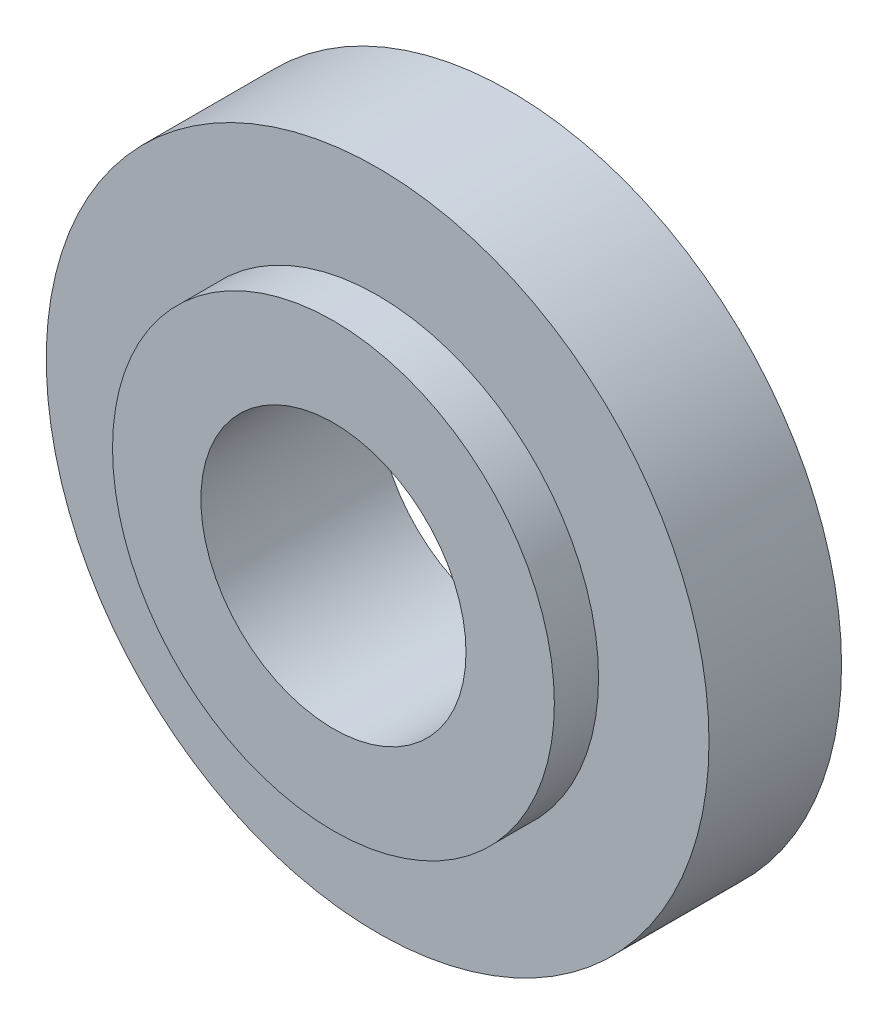
ISO-10303-21;
HEADER;
FILE_DESCRIPTION(('STEP AP214'),'2;1');
FILE_NAME('part.step','',(''),(''),'','','');
FILE_SCHEMA(('AUTOMOTIVE_DESIGN { 1 0 10303 214 1 1 1 1 }'));
ENDSEC;
DATA;
#1=APPLICATION_CONTEXT('core data for automotive mechanical design processes');
#2=APPLICATION_PROTOCOL_DEFINITION('international standard','automotive_design',2000,#1);
#3=PRODUCT_CONTEXT('',#1,'mechanical');
#4=PRODUCT('Part','Part','',(#3));
#5=PRODUCT_RELATED_PRODUCT_CATEGORY('part','',(#4));
#6=PRODUCT_DEFINITION_FORMATION('','',#4);
#7=PRODUCT_DEFINITION_CONTEXT('part definition',#1,'design');
#8=PRODUCT_DEFINITION('design','',#6,#7);
#9=PRODUCT_DEFINITION_SHAPE('','',#8);
#10=(LENGTH_UNIT() NAMED_UNIT(*) SI_UNIT(.MILLI.,.METRE.));
#11=(NAMED_UNIT(*) PLANE_ANGLE_UNIT() SI_UNIT($,.RADIAN.));
#12=(NAMED_UNIT(*) SI_UNIT($,.STERADIAN.) SOLID_ANGLE_UNIT());
#13=UNCERTAINTY_MEASURE_WITH_UNIT(LENGTH_MEASURE(1.E-05),#10,'distance_accuracy_value','');
#14=(GEOMETRIC_REPRESENTATION_CONTEXT(3) GLOBAL_UNCERTAINTY_ASSIGNED_CONTEXT((#13)) GLOBAL_UNIT_ASSIGNED_CONTEXT((#10,
#11,#12)) REPRESENTATION_CONTEXT('',''));
#15=CARTESIAN_POINT('',(0.,0.,0.));
#16=DIRECTION('',(0.,0.,1.));
#17=DIRECTION('',(1.,0.,0.));
#18=AXIS2_PLACEMENT_3D('',#15,#16,#17);
#19=CARTESIAN_POINT('',(0.,0.,-3.));
#20=DIRECTION('',(0.,0.,1.));
#21=DIRECTION('',(1.,0.,0.));
#22=AXIS2_PLACEMENT_3D('',#19,#20,#21);
#23=CYLINDRICAL_SURFACE('',#22,7.5);
#24=CARTESIAN_POINT('',(0.,0.,-3.));
#25=DIRECTION('',(0.,0.,1.));
#26=DIRECTION('',(1.,0.,0.));
#27=AXIS2_PLACEMENT_3D('',#24,#25,#26);
#28=CIRCLE('',#27,7.5);
#29=CARTESIAN_POINT('',(7.5,0.,-3.));
#30=VERTEX_POINT('',#29);
#31=EDGE_CURVE('E43',#30,#30,#28,.T.);
#32=ORIENTED_EDGE('',*,*,#31,.T.);
#33=EDGE_LOOP('',(#32));
#34=FACE_BOUND('',#33,.T.);
#35=CARTESIAN_POINT('',(0.,0.,0.));
#36=DIRECTION('',(0.,0.,1.));
#37=DIRECTION('',(1.,0.,0.));
#38=AXIS2_PLACEMENT_3D('',#35,#36,#37);
#39=CIRCLE('',#38,7.5);
#40=CARTESIAN_POINT('',(7.5,0.,0.));
#41=VERTEX_POINT('',#40);
#42=EDGE_CURVE('E39',#41,#41,#39,.T.);
#43=ORIENTED_EDGE('',*,*,#42,.F.);
#44=EDGE_LOOP('',(#43));
#45=FACE_BOUND('',#44,.T.);
#46=ADVANCED_FACE('F36',(#34,#45),#23,.T.);
#47=CARTESIAN_POINT('',(0.,0.,-3.));
#48=DIRECTION('',(0.,0.,1.));
#49=DIRECTION('',(1.,0.,0.));
#50=AXIS2_PLACEMENT_3D('',#47,#48,#49);
#51=CYLINDRICAL_SURFACE('',#50,3.);
#52=CARTESIAN_POINT('',(0.,0.,-3.));
#53=DIRECTION('',(0.,0.,1.));
#54=DIRECTION('',(1.,0.,0.));
#55=AXIS2_PLACEMENT_3D('',#52,#53,#54);
#56=CIRCLE('',#55,3.);
#57=CARTESIAN_POINT('',(3.,0.,-3.));
#58=VERTEX_POINT('',#57);
#59=EDGE_CURVE('E10',#58,#58,#56,.T.);
#60=ORIENTED_EDGE('',*,*,#59,.F.);
#61=EDGE_LOOP('',(#60));
#62=FACE_BOUND('',#61,.T.);
#63=CARTESIAN_POINT('',(0.,0.,1.));
#64=DIRECTION('',(0.,0.,1.));
#65=DIRECTION('',(1.,0.,0.));
#66=AXIS2_PLACEMENT_3D('',#63,#64,#65);
#67=CIRCLE('',#66,3.);
#68=CARTESIAN_POINT('',(3.,0.,1.));
#69=VERTEX_POINT('',#68);
#70=EDGE_CURVE('E52',#69,#69,#67,.T.);
#71=ORIENTED_EDGE('',*,*,#70,.T.);
#72=EDGE_LOOP('',(#71));
#73=FACE_BOUND('',#72,.T.);
#74=ADVANCED_FACE('F59',(#62,#73),#51,.F.);
#75=CARTESIAN_POINT('',(0.,0.,-3.));
#76=DIRECTION('',(0.,0.,1.));
#77=DIRECTION('',(1.,0.,0.));
#78=AXIS2_PLACEMENT_3D('',#75,#76,#77);
#79=PLANE('',#78);
#80=ORIENTED_EDGE('',*,*,#31,.F.);
#81=EDGE_LOOP('',(#80));
#82=FACE_BOUND('',#81,.T.);
#83=ORIENTED_EDGE('',*,*,#59,.T.);
#84=EDGE_LOOP('',(#83));
#85=FACE_BOUND('',#84,.T.);
#86=ADVANCED_FACE('F76',(#82,#85),#79,.F.);
#87=CARTESIAN_POINT('',(0.,0.,0.));
#88=DIRECTION('',(0.,0.,1.));
#89=DIRECTION('',(1.,0.,0.));
#90=AXIS2_PLACEMENT_3D('',#87,#88,#89);
#91=PLANE('',#90);
#92=CARTESIAN_POINT('',(0.,0.,0.));
#93=DIRECTION('',(0.,0.,1.));
#94=DIRECTION('',(1.,0.,0.));
#95=AXIS2_PLACEMENT_3D('',#92,#93,#94);
#96=CIRCLE('',#95,5.);
#97=CARTESIAN_POINT('',(5.,0.,0.));
#98=VERTEX_POINT('',#97);
#99=EDGE_CURVE('E49',#98,#98,#96,.T.);
#100=ORIENTED_EDGE('',*,*,#99,.F.);
#101=EDGE_LOOP('',(#100));
#102=FACE_BOUND('',#101,.T.);
#103=ORIENTED_EDGE('',*,*,#42,.T.);
#104=EDGE_LOOP('',(#103));
#105=FACE_BOUND('',#104,.T.);
#106=ADVANCED_FACE('F70',(#102,#105),#91,.T.);
#107=CARTESIAN_POINT('',(0.,0.,1.));
#108=DIRECTION('',(0.,0.,-1.));
#109=DIRECTION('',(-1.,0.,0.));
#110=AXIS2_PLACEMENT_3D('',#107,#108,#109);
#111=CYLINDRICAL_SURFACE('',#110,5.);
#112=CARTESIAN_POINT('',(0.,0.,1.));
#113=DIRECTION('',(0.,0.,1.));
#114=DIRECTION('',(1.,0.,0.));
#115=AXIS2_PLACEMENT_3D('',#112,#113,#114);
#116=CIRCLE('',#115,5.);
#117=CARTESIAN_POINT('',(5.,0.,1.));
#118=VERTEX_POINT('',#117);
#119=EDGE_CURVE('E53',#118,#118,#116,.T.);
#120=ORIENTED_EDGE('',*,*,#119,.F.);
#121=EDGE_LOOP('',(#120));
#122=FACE_BOUND('',#121,.T.);
#123=ORIENTED_EDGE('',*,*,#99,.T.);
#124=EDGE_LOOP('',(#123));
#125=FACE_BOUND('',#124,.T.);
#126=ADVANCED_FACE('F64',(#122,#125),#111,.T.);
#127=CARTESIAN_POINT('',(0.,0.,1.));
#128=DIRECTION('',(0.,0.,1.));
#129=DIRECTION('',(1.,0.,0.));
#130=AXIS2_PLACEMENT_3D('',#127,#128,#129);
#131=PLANE('',#130);
#132=ORIENTED_EDGE('',*,*,#70,.F.);
#133=EDGE_LOOP('',(#132));
#134=FACE_BOUND('',#133,.T.);
#135=ORIENTED_EDGE('',*,*,#119,.T.);
#136=EDGE_LOOP('',(#135));
#137=FACE_BOUND('',#136,.T.);
#138=ADVANCED_FACE('F61',(#134,#137),#131,.T.);
#139=CLOSED_SHELL('',(#46,#74,#86,#106,#126,#138));
#140=MANIFOLD_SOLID_BREP('B2',#139);
#141=ADVANCED_BREP_SHAPE_REPRESENTATION('',(#18,#140),#14);
#142=SHAPE_DEFINITION_REPRESENTATION(#9,#141);
ENDSEC;
END-ISO-10303-21;
